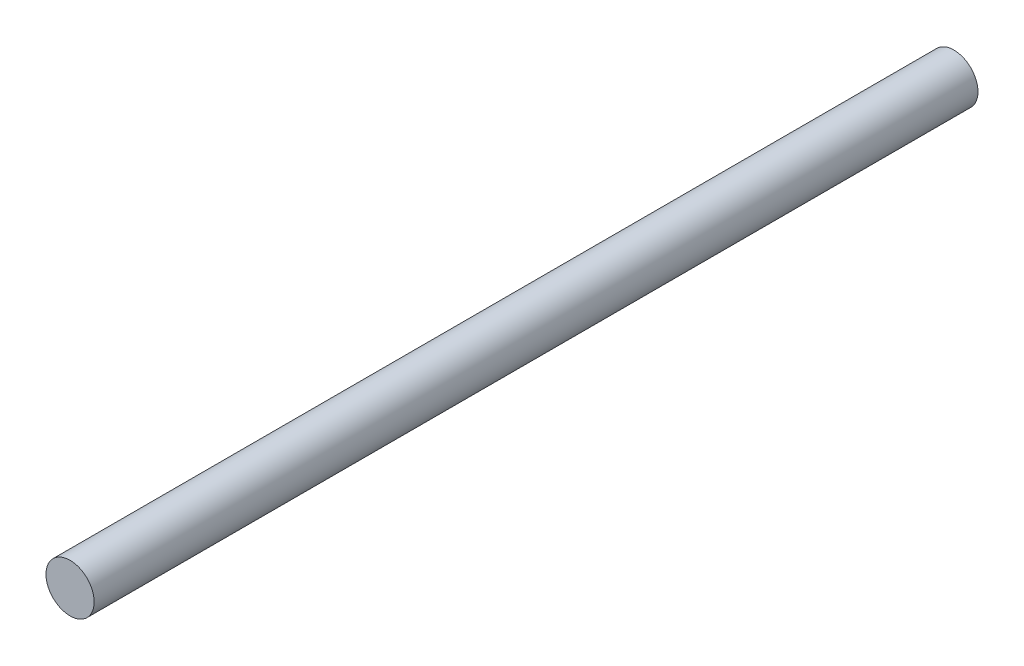
ISO-10303-21;
HEADER;
FILE_DESCRIPTION(('STEP AP214'),'2;1');
FILE_NAME('part.step','',(''),(''),'','','');
FILE_SCHEMA(('AUTOMOTIVE_DESIGN { 1 0 10303 214 1 1 1 1 }'));
ENDSEC;
DATA;
#1=APPLICATION_CONTEXT('core data for automotive mechanical design processes');
#2=APPLICATION_PROTOCOL_DEFINITION('international standard','automotive_design',2000,#1);
#3=PRODUCT_CONTEXT('',#1,'mechanical');
#4=PRODUCT('Part','Part','',(#3));
#5=PRODUCT_RELATED_PRODUCT_CATEGORY('part','',(#4));
#6=PRODUCT_DEFINITION_FORMATION('','',#4);
#7=PRODUCT_DEFINITION_CONTEXT('part definition',#1,'design');
#8=PRODUCT_DEFINITION('design','',#6,#7);
#9=PRODUCT_DEFINITION_SHAPE('','',#8);
#10=(LENGTH_UNIT() NAMED_UNIT(*) SI_UNIT(.MILLI.,.METRE.));
#11=(NAMED_UNIT(*) PLANE_ANGLE_UNIT() SI_UNIT($,.RADIAN.));
#12=(NAMED_UNIT(*) SI_UNIT($,.STERADIAN.) SOLID_ANGLE_UNIT());
#13=UNCERTAINTY_MEASURE_WITH_UNIT(LENGTH_MEASURE(1.E-05),#10,'distance_accuracy_value','');
#14=(GEOMETRIC_REPRESENTATION_CONTEXT(3) GLOBAL_UNCERTAINTY_ASSIGNED_CONTEXT((#13)) GLOBAL_UNIT_ASSIGNED_CONTEXT((#10,
#11,#12)) REPRESENTATION_CONTEXT('',''));
#15=CARTESIAN_POINT('',(0.,0.,0.));
#16=DIRECTION('',(0.,0.,1.));
#17=DIRECTION('',(1.,0.,0.));
#18=AXIS2_PLACEMENT_3D('',#15,#16,#17);
#19=CARTESIAN_POINT('',(0.,0.,110.));
#20=DIRECTION('',(0.,0.,-1.));
#21=DIRECTION('',(-1.,0.,0.));
#22=AXIS2_PLACEMENT_3D('',#19,#20,#21);
#23=CYLINDRICAL_SURFACE('',#22,3.);
#24=CARTESIAN_POINT('',(0.,0.,110.));
#25=DIRECTION('',(0.,0.,1.));
#26=DIRECTION('',(1.,0.,0.));
#27=AXIS2_PLACEMENT_3D('',#24,#25,#26);
#28=CIRCLE('',#27,3.);
#29=CARTESIAN_POINT('',(3.,0.,110.));
#30=VERTEX_POINT('',#29);
#31=EDGE_CURVE('E10',#30,#30,#28,.T.);
#32=ORIENTED_EDGE('',*,*,#31,.F.);
#33=EDGE_LOOP('',(#32));
#34=FACE_BOUND('',#33,.T.);
#35=CARTESIAN_POINT('',(0.,0.,0.));
#36=DIRECTION('',(0.,0.,1.));
#37=DIRECTION('',(1.,0.,0.));
#38=AXIS2_PLACEMENT_3D('',#35,#36,#37);
#39=CIRCLE('',#38,3.);
#40=CARTESIAN_POINT('',(3.,0.,0.));
#41=VERTEX_POINT('',#40);
#42=EDGE_CURVE('E36',#41,#41,#39,.T.);
#43=ORIENTED_EDGE('',*,*,#42,.T.);
#44=EDGE_LOOP('',(#43));
#45=FACE_BOUND('',#44,.T.);
#46=ADVANCED_FACE('F33',(#34,#45),#23,.T.);
#47=CARTESIAN_POINT('',(0.,0.,110.));
#48=DIRECTION('',(0.,0.,1.));
#49=DIRECTION('',(1.,0.,0.));
#50=AXIS2_PLACEMENT_3D('',#47,#48,#49);
#51=PLANE('',#50);
#52=ORIENTED_EDGE('',*,*,#31,.T.);
#53=EDGE_LOOP('',(#52));
#54=FACE_BOUND('',#53,.T.);
#55=ADVANCED_FACE('F48',(#54),#51,.T.);
#56=CARTESIAN_POINT('',(0.,0.,0.));
#57=DIRECTION('',(0.,0.,1.));
#58=DIRECTION('',(1.,0.,0.));
#59=AXIS2_PLACEMENT_3D('',#56,#57,#58);
#60=PLANE('',#59);
#61=ORIENTED_EDGE('',*,*,#42,.F.);
#62=EDGE_LOOP('',(#61));
#63=FACE_BOUND('',#62,.T.);
#64=ADVANCED_FACE('F46',(#63),#60,.F.);
#65=CLOSED_SHELL('',(#46,#55,#64));
#66=MANIFOLD_SOLID_BREP('B2',#65);
#67=ADVANCED_BREP_SHAPE_REPRESENTATION('',(#18,#66),#14);
#68=SHAPE_DEFINITION_REPRESENTATION(#9,#67);
ENDSEC;
END-ISO-10303-21;
